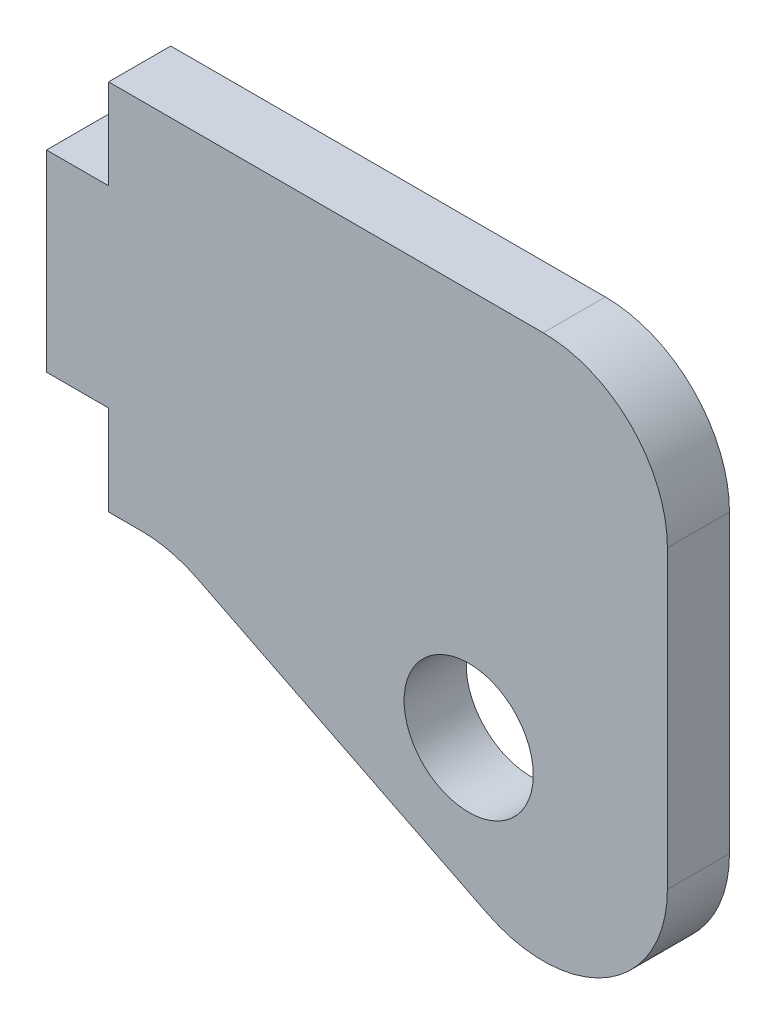
ISO-10303-21;
HEADER;
FILE_DESCRIPTION(('STEP AP214'),'2;1');
FILE_NAME('part.step','',(''),(''),'','','');
FILE_SCHEMA(('AUTOMOTIVE_DESIGN { 1 0 10303 214 1 1 1 1 }'));
ENDSEC;
DATA;
#1=APPLICATION_CONTEXT('core data for automotive mechanical design processes');
#2=APPLICATION_PROTOCOL_DEFINITION('international standard','automotive_design',2000,#1);
#3=PRODUCT_CONTEXT('',#1,'mechanical');
#4=PRODUCT('Part','Part','',(#3));
#5=PRODUCT_RELATED_PRODUCT_CATEGORY('part','',(#4));
#6=PRODUCT_DEFINITION_FORMATION('','',#4);
#7=PRODUCT_DEFINITION_CONTEXT('part definition',#1,'design');
#8=PRODUCT_DEFINITION('design','',#6,#7);
#9=PRODUCT_DEFINITION_SHAPE('','',#8);
#10=(LENGTH_UNIT() NAMED_UNIT(*) SI_UNIT(.MILLI.,.METRE.));
#11=(NAMED_UNIT(*) PLANE_ANGLE_UNIT() SI_UNIT($,.RADIAN.));
#12=(NAMED_UNIT(*) SI_UNIT($,.STERADIAN.) SOLID_ANGLE_UNIT());
#13=UNCERTAINTY_MEASURE_WITH_UNIT(LENGTH_MEASURE(1.E-05),#10,'distance_accuracy_value','');
#14=(GEOMETRIC_REPRESENTATION_CONTEXT(3) GLOBAL_UNCERTAINTY_ASSIGNED_CONTEXT((#13)) GLOBAL_UNIT_ASSIGNED_CONTEXT((#10,
#11,#12)) REPRESENTATION_CONTEXT('',''));
#15=CARTESIAN_POINT('',(0.,0.,0.));
#16=DIRECTION('',(0.,0.,1.));
#17=DIRECTION('',(1.,0.,0.));
#18=AXIS2_PLACEMENT_3D('',#15,#16,#17);
#19=CARTESIAN_POINT('',(31.75,9.525,3.175));
#20=DIRECTION('',(0.,-1.,0.));
#21=DIRECTION('',(1.,0.,0.));
#22=AXIS2_PLACEMENT_3D('',#19,#20,#21);
#23=PLANE('',#22);
#24=DIRECTION('',(-1.,0.,0.));
#25=VECTOR('',#24,1.);
#26=CARTESIAN_POINT('',(31.75,9.525,0.));
#27=LINE('',#26,#25);
#28=CARTESIAN_POINT('',(25.4,9.525,0.));
#29=VERTEX_POINT('',#28);
#30=CARTESIAN_POINT('',(3.175,9.525,0.));
#31=VERTEX_POINT('',#30);
#32=EDGE_CURVE('E149',#29,#31,#27,.T.);
#33=ORIENTED_EDGE('',*,*,#32,.T.);
#34=DIRECTION('',(0.,0.,1.));
#35=VECTOR('',#34,1.);
#36=CARTESIAN_POINT('',(3.175,9.525,0.));
#37=LINE('',#36,#35);
#38=CARTESIAN_POINT('',(3.175,9.525,3.175));
#39=VERTEX_POINT('',#38);
#40=EDGE_CURVE('E240',#31,#39,#37,.T.);
#41=ORIENTED_EDGE('',*,*,#40,.T.);
#42=DIRECTION('',(-1.,0.,0.));
#43=VECTOR('',#42,1.);
#44=CARTESIAN_POINT('',(31.75,9.525,3.175));
#45=LINE('',#44,#43);
#46=CARTESIAN_POINT('',(25.4,9.525,3.175));
#47=VERTEX_POINT('',#46);
#48=EDGE_CURVE('E155',#47,#39,#45,.T.);
#49=ORIENTED_EDGE('',*,*,#48,.F.);
#50=DIRECTION('',(0.,0.,-1.));
#51=VECTOR('',#50,1.);
#52=CARTESIAN_POINT('',(25.4,9.525,3.175));
#53=LINE('',#52,#51);
#54=EDGE_CURVE('E156',#47,#29,#53,.T.);
#55=ORIENTED_EDGE('',*,*,#54,.T.);
#56=EDGE_LOOP('',(#33,#41,#49,#55));
#57=FACE_BOUND('',#56,.T.);
#58=ADVANCED_FACE('F33',(#57),#23,.F.);
#59=CARTESIAN_POINT('',(0.,9.525,3.175));
#60=DIRECTION('',(1.,0.,0.));
#61=DIRECTION('',(0.,0.,-1.));
#62=AXIS2_PLACEMENT_3D('',#59,#60,#61);
#63=PLANE('',#62);
#64=DIRECTION('',(0.,-1.,0.));
#65=VECTOR('',#64,1.);
#66=CARTESIAN_POINT('',(0.,9.525,0.));
#67=LINE('',#66,#65);
#68=CARTESIAN_POINT('',(0.,4.92125,0.));
#69=VERTEX_POINT('',#68);
#70=CARTESIAN_POINT('',(0.,-4.92125,0.));
#71=VERTEX_POINT('',#70);
#72=EDGE_CURVE('E143',#69,#71,#67,.T.);
#73=ORIENTED_EDGE('',*,*,#72,.T.);
#74=DIRECTION('',(0.,0.,1.));
#75=VECTOR('',#74,1.);
#76=CARTESIAN_POINT('',(0.,-4.92125,0.));
#77=LINE('',#76,#75);
#78=CARTESIAN_POINT('',(0.,-4.92125,3.175));
#79=VERTEX_POINT('',#78);
#80=EDGE_CURVE('E210',#71,#79,#77,.T.);
#81=ORIENTED_EDGE('',*,*,#80,.T.);
#82=DIRECTION('',(0.,-1.,0.));
#83=VECTOR('',#82,1.);
#84=CARTESIAN_POINT('',(0.,9.525,3.175));
#85=LINE('',#84,#83);
#86=CARTESIAN_POINT('',(0.,4.92125,3.175));
#87=VERTEX_POINT('',#86);
#88=EDGE_CURVE('E196',#87,#79,#85,.T.);
#89=ORIENTED_EDGE('',*,*,#88,.F.);
#90=DIRECTION('',(0.,0.,1.));
#91=VECTOR('',#90,1.);
#92=CARTESIAN_POINT('',(0.,4.92125,0.));
#93=LINE('',#92,#91);
#94=EDGE_CURVE('E213',#69,#87,#93,.T.);
#95=ORIENTED_EDGE('',*,*,#94,.F.);
#96=EDGE_LOOP('',(#73,#81,#89,#95));
#97=FACE_BOUND('',#96,.T.);
#98=ADVANCED_FACE('F226',(#97),#63,.F.);
#99=CARTESIAN_POINT('',(0.,-9.525,3.175));
#100=DIRECTION('',(0.,1.,0.));
#101=DIRECTION('',(0.,0.,1.));
#102=AXIS2_PLACEMENT_3D('',#99,#100,#101);
#103=PLANE('',#102);
#104=DIRECTION('',(1.,0.,0.));
#105=VECTOR('',#104,1.);
#106=CARTESIAN_POINT('',(0.,-9.525,3.175));
#107=LINE('',#106,#105);
#108=CARTESIAN_POINT('',(3.175,-9.525,3.175));
#109=VERTEX_POINT('',#108);
#110=CARTESIAN_POINT('',(4.85096834287634,-9.525,3.175));
#111=VERTEX_POINT('',#110);
#112=EDGE_CURVE('E137',#109,#111,#107,.T.);
#113=ORIENTED_EDGE('',*,*,#112,.F.);
#114=DIRECTION('',(0.,0.,1.));
#115=VECTOR('',#114,1.);
#116=CARTESIAN_POINT('',(3.175,-9.525,0.));
#117=LINE('',#116,#115);
#118=CARTESIAN_POINT('',(3.175,-9.525,0.));
#119=VERTEX_POINT('',#118);
#120=EDGE_CURVE('E124',#119,#109,#117,.T.);
#121=ORIENTED_EDGE('',*,*,#120,.F.);
#122=DIRECTION('',(1.,0.,0.));
#123=VECTOR('',#122,1.);
#124=CARTESIAN_POINT('',(0.,-9.525,0.));
#125=LINE('',#124,#123);
#126=CARTESIAN_POINT('',(4.85096834287634,-9.525,0.));
#127=VERTEX_POINT('',#126);
#128=EDGE_CURVE('E135',#119,#127,#125,.T.);
#129=ORIENTED_EDGE('',*,*,#128,.T.);
#130=DIRECTION('',(0.,0.,-1.));
#131=VECTOR('',#130,1.);
#132=CARTESIAN_POINT('',(4.85096834287634,-9.525,3.175));
#133=LINE('',#132,#131);
#134=EDGE_CURVE('E178',#127,#111,#133,.F.);
#135=ORIENTED_EDGE('',*,*,#134,.T.);
#136=EDGE_LOOP('',(#113,#121,#129,#135));
#137=FACE_BOUND('',#136,.T.);
#138=ADVANCED_FACE('F133',(#137),#103,.F.);
#139=CARTESIAN_POINT('',(6.35,-9.525,3.175));
#140=DIRECTION('',(0.447213595499958,0.894427190999916,0.));
#141=DIRECTION('',(-0.894427190999916,0.447213595499958,0.));
#142=AXIS2_PLACEMENT_3D('',#139,#140,#141);
#143=PLANE('',#142);
#144=DIRECTION('',(0.894427190999916,-0.447213595499958,0.));
#145=VECTOR('',#144,1.);
#146=CARTESIAN_POINT('',(6.35,-9.525,0.));
#147=LINE('',#146,#145);
#148=CARTESIAN_POINT('',(7.69077467430107,-10.1953873371505,0.));
#149=VERTEX_POINT('',#148);
#150=CARTESIAN_POINT('',(22.5601936685753,-17.6300968342876,0.));
#151=VERTEX_POINT('',#150);
#152=EDGE_CURVE('E142',#149,#151,#147,.T.);
#153=ORIENTED_EDGE('',*,*,#152,.T.);
#154=DIRECTION('',(0.,0.,-1.));
#155=VECTOR('',#154,1.);
#156=CARTESIAN_POINT('',(22.5601936685753,-17.6300968342876,3.175));
#157=LINE('',#156,#155);
#158=CARTESIAN_POINT('',(22.5601936685753,-17.6300968342876,3.175));
#159=VERTEX_POINT('',#158);
#160=EDGE_CURVE('E176',#151,#159,#157,.F.);
#161=ORIENTED_EDGE('',*,*,#160,.T.);
#162=DIRECTION('',(0.894427190999916,-0.447213595499958,0.));
#163=VECTOR('',#162,1.);
#164=CARTESIAN_POINT('',(6.35,-9.525,3.175));
#165=LINE('',#164,#163);
#166=CARTESIAN_POINT('',(7.69077467430107,-10.1953873371505,3.175));
#167=VERTEX_POINT('',#166);
#168=EDGE_CURVE('E188',#167,#159,#165,.T.);
#169=ORIENTED_EDGE('',*,*,#168,.F.);
#170=DIRECTION('',(0.,0.,-1.));
#171=VECTOR('',#170,1.);
#172=CARTESIAN_POINT('',(7.69077467430107,-10.1953873371505,0.));
#173=LINE('',#172,#171);
#174=EDGE_CURVE('E173',#167,#149,#173,.T.);
#175=ORIENTED_EDGE('',*,*,#174,.T.);
#176=EDGE_LOOP('',(#153,#161,#169,#175));
#177=FACE_BOUND('',#176,.T.);
#178=ADVANCED_FACE('F191',(#177),#143,.F.);
#179=CARTESIAN_POINT('',(31.75,-22.225,3.175));
#180=DIRECTION('',(-1.,0.,0.));
#181=DIRECTION('',(0.,0.,1.));
#182=AXIS2_PLACEMENT_3D('',#179,#180,#181);
#183=PLANE('',#182);
#184=DIRECTION('',(0.,1.,0.));
#185=VECTOR('',#184,1.);
#186=CARTESIAN_POINT('',(31.75,-22.225,0.));
#187=LINE('',#186,#185);
#188=CARTESIAN_POINT('',(31.75,-11.9504841714382,0.));
#189=VERTEX_POINT('',#188);
#190=CARTESIAN_POINT('',(31.75,3.175,0.));
#191=VERTEX_POINT('',#190);
#192=EDGE_CURVE('E146',#189,#191,#187,.T.);
#193=ORIENTED_EDGE('',*,*,#192,.T.);
#194=DIRECTION('',(0.,0.,-1.));
#195=VECTOR('',#194,1.);
#196=CARTESIAN_POINT('',(31.75,3.175,3.175));
#197=LINE('',#196,#195);
#198=CARTESIAN_POINT('',(31.75,3.175,3.175));
#199=VERTEX_POINT('',#198);
#200=EDGE_CURVE('E167',#191,#199,#197,.F.);
#201=ORIENTED_EDGE('',*,*,#200,.T.);
#202=DIRECTION('',(0.,1.,0.));
#203=VECTOR('',#202,1.);
#204=CARTESIAN_POINT('',(31.75,-22.225,3.175));
#205=LINE('',#204,#203);
#206=CARTESIAN_POINT('',(31.75,-11.9504841714382,3.175));
#207=VERTEX_POINT('',#206);
#208=EDGE_CURVE('E160',#207,#199,#205,.T.);
#209=ORIENTED_EDGE('',*,*,#208,.F.);
#210=DIRECTION('',(0.,0.,-1.));
#211=VECTOR('',#210,1.);
#212=CARTESIAN_POINT('',(31.75,-11.9504841714382,3.175));
#213=LINE('',#212,#211);
#214=EDGE_CURVE('E164',#207,#189,#213,.T.);
#215=ORIENTED_EDGE('',*,*,#214,.T.);
#216=EDGE_LOOP('',(#193,#201,#209,#215));
#217=FACE_BOUND('',#216,.T.);
#218=ADVANCED_FACE('F278',(#217),#183,.F.);
#219=CARTESIAN_POINT('',(0.,0.,3.175));
#220=DIRECTION('',(0.,0.,1.));
#221=DIRECTION('',(1.,0.,0.));
#222=AXIS2_PLACEMENT_3D('',#219,#220,#221);
#223=PLANE('',#222);
#224=DIRECTION('',(-1.,0.,0.));
#225=VECTOR('',#224,1.);
#226=CARTESIAN_POINT('',(0.,-4.92125,3.175));
#227=LINE('',#226,#225);
#228=CARTESIAN_POINT('',(3.175,-4.92125,3.175));
#229=VERTEX_POINT('',#228);
#230=EDGE_CURVE('E129',#229,#79,#227,.T.);
#231=ORIENTED_EDGE('',*,*,#230,.F.);
#232=DIRECTION('',(0.,1.,0.));
#233=VECTOR('',#232,1.);
#234=CARTESIAN_POINT('',(3.175,-9.525,3.175));
#235=LINE('',#234,#233);
#236=EDGE_CURVE('E241',#109,#229,#235,.T.);
#237=ORIENTED_EDGE('',*,*,#236,.F.);
#238=ORIENTED_EDGE('',*,*,#112,.T.);
#239=CARTESIAN_POINT('',(4.85096834287634,-15.875,3.175));
#240=DIRECTION('',(0.,0.,1.));
#241=DIRECTION('',(1.,0.,0.));
#242=AXIS2_PLACEMENT_3D('',#239,#240,#241);
#243=CIRCLE('',#242,6.35);
#244=EDGE_CURVE('E11',#111,#167,#243,.F.);
#245=ORIENTED_EDGE('',*,*,#244,.T.);
#246=ORIENTED_EDGE('',*,*,#168,.T.);
#247=CARTESIAN_POINT('',(25.4,-11.9504841714382,3.175));
#248=DIRECTION('',(0.,0.,1.));
#249=DIRECTION('',(1.,0.,0.));
#250=AXIS2_PLACEMENT_3D('',#247,#248,#249);
#251=CIRCLE('',#250,6.35);
#252=EDGE_CURVE('E169',#159,#207,#251,.T.);
#253=ORIENTED_EDGE('',*,*,#252,.T.);
#254=ORIENTED_EDGE('',*,*,#208,.T.);
#255=CARTESIAN_POINT('',(25.4,3.175,3.175));
#256=DIRECTION('',(0.,0.,1.));
#257=DIRECTION('',(1.,0.,0.));
#258=AXIS2_PLACEMENT_3D('',#255,#256,#257);
#259=CIRCLE('',#258,6.35);
#260=EDGE_CURVE('E171',#199,#47,#259,.T.);
#261=ORIENTED_EDGE('',*,*,#260,.T.);
#262=ORIENTED_EDGE('',*,*,#48,.T.);
#263=DIRECTION('',(0.,1.,0.));
#264=VECTOR('',#263,1.);
#265=CARTESIAN_POINT('',(3.175,9.525,3.175));
#266=LINE('',#265,#264);
#267=CARTESIAN_POINT('',(3.175,4.92125,3.175));
#268=VERTEX_POINT('',#267);
#269=EDGE_CURVE('E236',#268,#39,#266,.T.);
#270=ORIENTED_EDGE('',*,*,#269,.F.);
#271=DIRECTION('',(1.,0.,0.));
#272=VECTOR('',#271,1.);
#273=CARTESIAN_POINT('',(0.,4.92125,3.175));
#274=LINE('',#273,#272);
#275=EDGE_CURVE('E222',#87,#268,#274,.T.);
#276=ORIENTED_EDGE('',*,*,#275,.F.);
#277=ORIENTED_EDGE('',*,*,#88,.T.);
#278=EDGE_LOOP('',(#231,#237,#238,#245,#246,#253,#254,#261,#262,#270,#276,#277));
#279=FACE_BOUND('',#278,.T.);
#280=CARTESIAN_POINT('',(21.5882999780129,-10.315871598903,3.175));
#281=DIRECTION('',(0.,0.,1.));
#282=DIRECTION('',(1.,0.,0.));
#283=AXIS2_PLACEMENT_3D('',#280,#281,#282);
#284=CIRCLE('',#283,3.302);
#285=CARTESIAN_POINT('',(24.8902999780129,-10.315871598903,3.175));
#286=VERTEX_POINT('',#285);
#287=EDGE_CURVE('E205',#286,#286,#284,.T.);
#288=ORIENTED_EDGE('',*,*,#287,.F.);
#289=EDGE_LOOP('',(#288));
#290=FACE_BOUND('',#289,.T.);
#291=ADVANCED_FACE('F186',(#279,#290),#223,.T.);
#292=CARTESIAN_POINT('',(0.,0.,0.));
#293=DIRECTION('',(0.,0.,1.));
#294=DIRECTION('',(1.,0.,0.));
#295=AXIS2_PLACEMENT_3D('',#292,#293,#294);
#296=PLANE('',#295);
#297=CARTESIAN_POINT('',(21.5882999780129,-10.315871598903,0.));
#298=DIRECTION('',(0.,0.,1.));
#299=DIRECTION('',(1.,0.,0.));
#300=AXIS2_PLACEMENT_3D('',#297,#298,#299);
#301=CIRCLE('',#300,3.302);
#302=CARTESIAN_POINT('',(24.8902999780129,-10.315871598903,0.));
#303=VERTEX_POINT('',#302);
#304=EDGE_CURVE('E200',#303,#303,#301,.T.);
#305=ORIENTED_EDGE('',*,*,#304,.T.);
#306=EDGE_LOOP('',(#305));
#307=FACE_BOUND('',#306,.T.);
#308=DIRECTION('',(0.,1.,0.));
#309=VECTOR('',#308,1.);
#310=CARTESIAN_POINT('',(3.175,-9.525,0.));
#311=LINE('',#310,#309);
#312=CARTESIAN_POINT('',(3.175,-4.92125,0.));
#313=VERTEX_POINT('',#312);
#314=EDGE_CURVE('E120',#119,#313,#311,.T.);
#315=ORIENTED_EDGE('',*,*,#314,.T.);
#316=DIRECTION('',(-1.,0.,0.));
#317=VECTOR('',#316,1.);
#318=CARTESIAN_POINT('',(0.,-4.92125,0.));
#319=LINE('',#318,#317);
#320=EDGE_CURVE('E48',#313,#71,#319,.T.);
#321=ORIENTED_EDGE('',*,*,#320,.T.);
#322=ORIENTED_EDGE('',*,*,#72,.F.);
#323=DIRECTION('',(1.,0.,0.));
#324=VECTOR('',#323,1.);
#325=CARTESIAN_POINT('',(0.,4.92125,0.));
#326=LINE('',#325,#324);
#327=CARTESIAN_POINT('',(3.175,4.92125,0.));
#328=VERTEX_POINT('',#327);
#329=EDGE_CURVE('E233',#69,#328,#326,.T.);
#330=ORIENTED_EDGE('',*,*,#329,.T.);
#331=DIRECTION('',(0.,1.,0.));
#332=VECTOR('',#331,1.);
#333=CARTESIAN_POINT('',(3.175,9.525,0.));
#334=LINE('',#333,#332);
#335=EDGE_CURVE('E56',#328,#31,#334,.T.);
#336=ORIENTED_EDGE('',*,*,#335,.T.);
#337=ORIENTED_EDGE('',*,*,#32,.F.);
#338=CARTESIAN_POINT('',(25.4,3.175,0.));
#339=DIRECTION('',(0.,0.,1.));
#340=DIRECTION('',(1.,0.,0.));
#341=AXIS2_PLACEMENT_3D('',#338,#339,#340);
#342=CIRCLE('',#341,6.35);
#343=EDGE_CURVE('E162',#29,#191,#342,.F.);
#344=ORIENTED_EDGE('',*,*,#343,.T.);
#345=ORIENTED_EDGE('',*,*,#192,.F.);
#346=CARTESIAN_POINT('',(25.4,-11.9504841714382,0.));
#347=DIRECTION('',(0.,0.,1.));
#348=DIRECTION('',(1.,0.,0.));
#349=AXIS2_PLACEMENT_3D('',#346,#347,#348);
#350=CIRCLE('',#349,6.35);
#351=EDGE_CURVE('E159',#189,#151,#350,.F.);
#352=ORIENTED_EDGE('',*,*,#351,.T.);
#353=ORIENTED_EDGE('',*,*,#152,.F.);
#354=CARTESIAN_POINT('',(4.85096834287634,-15.875,0.));
#355=DIRECTION('',(0.,0.,1.));
#356=DIRECTION('',(1.,0.,0.));
#357=AXIS2_PLACEMENT_3D('',#354,#355,#356);
#358=CIRCLE('',#357,6.35);
#359=EDGE_CURVE('E41',#149,#127,#358,.T.);
#360=ORIENTED_EDGE('',*,*,#359,.T.);
#361=ORIENTED_EDGE('',*,*,#128,.F.);
#362=EDGE_LOOP('',(#315,#321,#322,#330,#336,#337,#344,#345,#352,#353,#360,#361));
#363=FACE_BOUND('',#362,.T.);
#364=ADVANCED_FACE('F139',(#307,#363),#296,.F.);
#365=CARTESIAN_POINT('',(25.4,3.175,3.175));
#366=DIRECTION('',(0.,0.,-1.));
#367=DIRECTION('',(-1.,0.,0.));
#368=AXIS2_PLACEMENT_3D('',#365,#366,#367);
#369=CYLINDRICAL_SURFACE('',#368,6.35);
#370=ORIENTED_EDGE('',*,*,#260,.F.);
#371=ORIENTED_EDGE('',*,*,#200,.F.);
#372=ORIENTED_EDGE('',*,*,#343,.F.);
#373=ORIENTED_EDGE('',*,*,#54,.F.);
#374=EDGE_LOOP('',(#370,#371,#372,#373));
#375=FACE_BOUND('',#374,.T.);
#376=ADVANCED_FACE('F264',(#375),#369,.T.);
#377=CARTESIAN_POINT('',(25.4,-11.9504841714382,3.175));
#378=DIRECTION('',(0.,0.,-1.));
#379=DIRECTION('',(-1.,0.,0.));
#380=AXIS2_PLACEMENT_3D('',#377,#378,#379);
#381=CYLINDRICAL_SURFACE('',#380,6.35);
#382=ORIENTED_EDGE('',*,*,#252,.F.);
#383=ORIENTED_EDGE('',*,*,#160,.F.);
#384=ORIENTED_EDGE('',*,*,#351,.F.);
#385=ORIENTED_EDGE('',*,*,#214,.F.);
#386=EDGE_LOOP('',(#382,#383,#384,#385));
#387=FACE_BOUND('',#386,.T.);
#388=ADVANCED_FACE('F266',(#387),#381,.T.);
#389=CARTESIAN_POINT('',(4.85096834287634,-15.875,3.175));
#390=DIRECTION('',(0.,0.,1.));
#391=DIRECTION('',(1.,0.,0.));
#392=AXIS2_PLACEMENT_3D('',#389,#390,#391);
#393=CYLINDRICAL_SURFACE('',#392,6.35);
#394=ORIENTED_EDGE('',*,*,#244,.F.);
#395=ORIENTED_EDGE('',*,*,#134,.F.);
#396=ORIENTED_EDGE('',*,*,#359,.F.);
#397=ORIENTED_EDGE('',*,*,#174,.F.);
#398=EDGE_LOOP('',(#394,#395,#396,#397));
#399=FACE_BOUND('',#398,.T.);
#400=ADVANCED_FACE('F35',(#399),#393,.F.);
#401=CARTESIAN_POINT('',(21.5882999780129,-10.315871598903,0.));
#402=DIRECTION('',(0.,0.,1.));
#403=DIRECTION('',(1.,0.,0.));
#404=AXIS2_PLACEMENT_3D('',#401,#402,#403);
#405=CYLINDRICAL_SURFACE('',#404,3.302);
#406=ORIENTED_EDGE('',*,*,#304,.F.);
#407=EDGE_LOOP('',(#406));
#408=FACE_BOUND('',#407,.T.);
#409=ORIENTED_EDGE('',*,*,#287,.T.);
#410=EDGE_LOOP('',(#409));
#411=FACE_BOUND('',#410,.T.);
#412=ADVANCED_FACE('F273',(#408,#411),#405,.F.);
#413=CARTESIAN_POINT('',(3.175,9.525,0.));
#414=DIRECTION('',(1.,0.,0.));
#415=DIRECTION('',(0.,0.,-1.));
#416=AXIS2_PLACEMENT_3D('',#413,#414,#415);
#417=PLANE('',#416);
#418=ORIENTED_EDGE('',*,*,#269,.T.);
#419=ORIENTED_EDGE('',*,*,#40,.F.);
#420=ORIENTED_EDGE('',*,*,#335,.F.);
#421=DIRECTION('',(0.,0.,1.));
#422=VECTOR('',#421,1.);
#423=CARTESIAN_POINT('',(3.175,4.92125,0.));
#424=LINE('',#423,#422);
#425=EDGE_CURVE('E242',#328,#268,#424,.T.);
#426=ORIENTED_EDGE('',*,*,#425,.T.);
#427=EDGE_LOOP('',(#418,#419,#420,#426));
#428=FACE_BOUND('',#427,.T.);
#429=ADVANCED_FACE('F254',(#428),#417,.F.);
#430=CARTESIAN_POINT('',(0.,4.92125,0.));
#431=DIRECTION('',(0.,-1.,0.));
#432=DIRECTION('',(0.,0.,-1.));
#433=AXIS2_PLACEMENT_3D('',#430,#431,#432);
#434=PLANE('',#433);
#435=ORIENTED_EDGE('',*,*,#275,.T.);
#436=ORIENTED_EDGE('',*,*,#425,.F.);
#437=ORIENTED_EDGE('',*,*,#329,.F.);
#438=ORIENTED_EDGE('',*,*,#94,.T.);
#439=EDGE_LOOP('',(#435,#436,#437,#438));
#440=FACE_BOUND('',#439,.T.);
#441=ADVANCED_FACE('F244',(#440),#434,.F.);
#442=CARTESIAN_POINT('',(0.,-4.92125,0.));
#443=DIRECTION('',(0.,1.,0.));
#444=DIRECTION('',(0.,0.,1.));
#445=AXIS2_PLACEMENT_3D('',#442,#443,#444);
#446=PLANE('',#445);
#447=ORIENTED_EDGE('',*,*,#230,.T.);
#448=ORIENTED_EDGE('',*,*,#80,.F.);
#449=ORIENTED_EDGE('',*,*,#320,.F.);
#450=DIRECTION('',(0.,0.,1.));
#451=VECTOR('',#450,1.);
#452=CARTESIAN_POINT('',(3.175,-4.92125,0.));
#453=LINE('',#452,#451);
#454=EDGE_CURVE('E126',#313,#229,#453,.T.);
#455=ORIENTED_EDGE('',*,*,#454,.T.);
#456=EDGE_LOOP('',(#447,#448,#449,#455));
#457=FACE_BOUND('',#456,.T.);
#458=ADVANCED_FACE('F246',(#457),#446,.F.);
#459=CARTESIAN_POINT('',(3.175,-9.525,0.));
#460=DIRECTION('',(1.,0.,0.));
#461=DIRECTION('',(0.,1.,0.));
#462=AXIS2_PLACEMENT_3D('',#459,#460,#461);
#463=PLANE('',#462);
#464=ORIENTED_EDGE('',*,*,#236,.T.);
#465=ORIENTED_EDGE('',*,*,#454,.F.);
#466=ORIENTED_EDGE('',*,*,#314,.F.);
#467=ORIENTED_EDGE('',*,*,#120,.T.);
#468=EDGE_LOOP('',(#464,#465,#466,#467));
#469=FACE_BOUND('',#468,.T.);
#470=ADVANCED_FACE('F123',(#469),#463,.F.);
#471=CLOSED_SHELL('',(#58,#98,#138,#178,#218,#291,#364,#376,#388,#400,#412,#429,#441,#458,#470));
#472=MANIFOLD_SOLID_BREP('B2',#471);
#473=ADVANCED_BREP_SHAPE_REPRESENTATION('',(#18,#472),#14);
#474=SHAPE_DEFINITION_REPRESENTATION(#9,#473);
ENDSEC;
END-ISO-10303-21;
